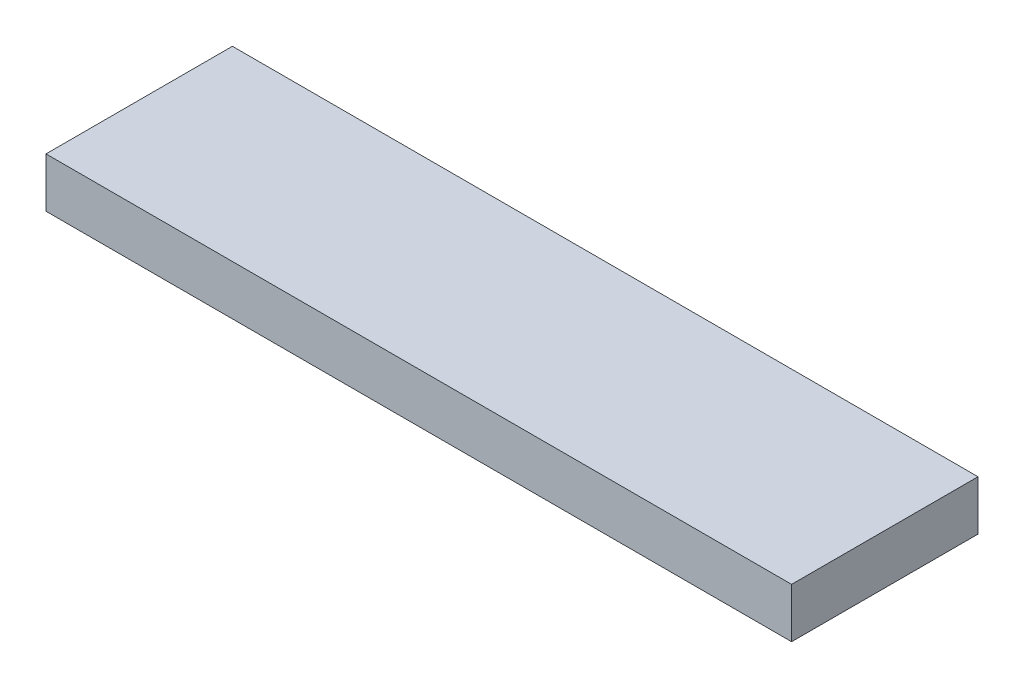
ISO-10303-21;
HEADER;
FILE_DESCRIPTION(('STEP AP214'),'2;1');
FILE_NAME('part.step','',(''),(''),'','','');
FILE_SCHEMA(('AUTOMOTIVE_DESIGN { 1 0 10303 214 1 1 1 1 }'));
ENDSEC;
DATA;
#1=APPLICATION_CONTEXT('core data for automotive mechanical design processes');
#2=APPLICATION_PROTOCOL_DEFINITION('international standard','automotive_design',2000,#1);
#3=PRODUCT_CONTEXT('',#1,'mechanical');
#4=PRODUCT('Part','Part','',(#3));
#5=PRODUCT_RELATED_PRODUCT_CATEGORY('part','',(#4));
#6=PRODUCT_DEFINITION_FORMATION('','',#4);
#7=PRODUCT_DEFINITION_CONTEXT('part definition',#1,'design');
#8=PRODUCT_DEFINITION('design','',#6,#7);
#9=PRODUCT_DEFINITION_SHAPE('','',#8);
#10=(LENGTH_UNIT() NAMED_UNIT(*) SI_UNIT(.MILLI.,.METRE.));
#11=(NAMED_UNIT(*) PLANE_ANGLE_UNIT() SI_UNIT($,.RADIAN.));
#12=(NAMED_UNIT(*) SI_UNIT($,.STERADIAN.) SOLID_ANGLE_UNIT());
#13=UNCERTAINTY_MEASURE_WITH_UNIT(LENGTH_MEASURE(1.E-05),#10,'distance_accuracy_value','');
#14=(GEOMETRIC_REPRESENTATION_CONTEXT(3) GLOBAL_UNCERTAINTY_ASSIGNED_CONTEXT((#13)) GLOBAL_UNIT_ASSIGNED_CONTEXT((#10,
#11,#12)) REPRESENTATION_CONTEXT('',''));
#15=CARTESIAN_POINT('',(0.,0.,0.));
#16=DIRECTION('',(0.,0.,1.));
#17=DIRECTION('',(1.,0.,0.));
#18=AXIS2_PLACEMENT_3D('',#15,#16,#17);
#19=CARTESIAN_POINT('',(-38.1,5.08,-9.525));
#20=DIRECTION('',(1.,0.,0.));
#21=DIRECTION('',(0.,0.,-1.));
#22=AXIS2_PLACEMENT_3D('',#19,#20,#21);
#23=PLANE('',#22);
#24=DIRECTION('',(0.,0.,1.));
#25=VECTOR('',#24,1.);
#26=CARTESIAN_POINT('',(-38.1,0.,-9.525));
#27=LINE('',#26,#25);
#28=CARTESIAN_POINT('',(-38.1,0.,-9.525));
#29=VERTEX_POINT('',#28);
#30=CARTESIAN_POINT('',(-38.1,0.,9.52500000000001));
#31=VERTEX_POINT('',#30);
#32=EDGE_CURVE('E111',#29,#31,#27,.T.);
#33=ORIENTED_EDGE('',*,*,#32,.T.);
#34=DIRECTION('',(0.,-1.,0.));
#35=VECTOR('',#34,1.);
#36=CARTESIAN_POINT('',(-38.1,5.08,9.52500000000001));
#37=LINE('',#36,#35);
#38=CARTESIAN_POINT('',(-38.1,5.08,9.52500000000001));
#39=VERTEX_POINT('',#38);
#40=EDGE_CURVE('E11',#39,#31,#37,.T.);
#41=ORIENTED_EDGE('',*,*,#40,.F.);
#42=DIRECTION('',(0.,0.,1.));
#43=VECTOR('',#42,1.);
#44=CARTESIAN_POINT('',(-38.1,5.08,-9.525));
#45=LINE('',#44,#43);
#46=CARTESIAN_POINT('',(-38.1,5.08,-9.525));
#47=VERTEX_POINT('',#46);
#48=EDGE_CURVE('E95',#47,#39,#45,.T.);
#49=ORIENTED_EDGE('',*,*,#48,.F.);
#50=DIRECTION('',(0.,-1.,0.));
#51=VECTOR('',#50,1.);
#52=CARTESIAN_POINT('',(-38.1,5.08,-9.525));
#53=LINE('',#52,#51);
#54=EDGE_CURVE('E107',#47,#29,#53,.T.);
#55=ORIENTED_EDGE('',*,*,#54,.T.);
#56=EDGE_LOOP('',(#33,#41,#49,#55));
#57=FACE_BOUND('',#56,.T.);
#58=ADVANCED_FACE('F43',(#57),#23,.F.);
#59=CARTESIAN_POINT('',(38.1,5.08,9.525));
#60=DIRECTION('',(0.,0.,-1.));
#61=DIRECTION('',(-1.,0.,0.));
#62=AXIS2_PLACEMENT_3D('',#59,#60,#61);
#63=PLANE('',#62);
#64=DIRECTION('',(1.,0.,0.));
#65=VECTOR('',#64,1.);
#66=CARTESIAN_POINT('',(38.1,0.,9.525));
#67=LINE('',#66,#65);
#68=CARTESIAN_POINT('',(38.1,0.,9.525));
#69=VERTEX_POINT('',#68);
#70=EDGE_CURVE('E100',#31,#69,#67,.T.);
#71=ORIENTED_EDGE('',*,*,#70,.T.);
#72=DIRECTION('',(0.,-1.,0.));
#73=VECTOR('',#72,1.);
#74=CARTESIAN_POINT('',(38.1,5.08,9.525));
#75=LINE('',#74,#73);
#76=CARTESIAN_POINT('',(38.1,5.08,9.525));
#77=VERTEX_POINT('',#76);
#78=EDGE_CURVE('E52',#77,#69,#75,.T.);
#79=ORIENTED_EDGE('',*,*,#78,.F.);
#80=DIRECTION('',(1.,0.,0.));
#81=VECTOR('',#80,1.);
#82=CARTESIAN_POINT('',(38.1,5.08,9.525));
#83=LINE('',#82,#81);
#84=EDGE_CURVE('E90',#39,#77,#83,.T.);
#85=ORIENTED_EDGE('',*,*,#84,.F.);
#86=ORIENTED_EDGE('',*,*,#40,.T.);
#87=EDGE_LOOP('',(#71,#79,#85,#86));
#88=FACE_BOUND('',#87,.T.);
#89=ADVANCED_FACE('F99',(#88),#63,.F.);
#90=CARTESIAN_POINT('',(38.1,5.08,-9.52500000000001));
#91=DIRECTION('',(-1.,0.,0.));
#92=DIRECTION('',(0.,0.,1.));
#93=AXIS2_PLACEMENT_3D('',#90,#91,#92);
#94=PLANE('',#93);
#95=DIRECTION('',(0.,0.,-1.));
#96=VECTOR('',#95,1.);
#97=CARTESIAN_POINT('',(38.1,0.,-9.52500000000001));
#98=LINE('',#97,#96);
#99=CARTESIAN_POINT('',(38.1,0.,-9.52500000000001));
#100=VERTEX_POINT('',#99);
#101=EDGE_CURVE('E77',#69,#100,#98,.T.);
#102=ORIENTED_EDGE('',*,*,#101,.T.);
#103=DIRECTION('',(0.,-1.,0.));
#104=VECTOR('',#103,1.);
#105=CARTESIAN_POINT('',(38.1,5.08,-9.52500000000001));
#106=LINE('',#105,#104);
#107=CARTESIAN_POINT('',(38.1,5.08,-9.52500000000001));
#108=VERTEX_POINT('',#107);
#109=EDGE_CURVE('E102',#108,#100,#106,.T.);
#110=ORIENTED_EDGE('',*,*,#109,.F.);
#111=DIRECTION('',(0.,0.,-1.));
#112=VECTOR('',#111,1.);
#113=CARTESIAN_POINT('',(38.1,5.08,-9.52500000000001));
#114=LINE('',#113,#112);
#115=EDGE_CURVE('E93',#77,#108,#114,.T.);
#116=ORIENTED_EDGE('',*,*,#115,.F.);
#117=ORIENTED_EDGE('',*,*,#78,.T.);
#118=EDGE_LOOP('',(#102,#110,#116,#117));
#119=FACE_BOUND('',#118,.T.);
#120=ADVANCED_FACE('F103',(#119),#94,.F.);
#121=CARTESIAN_POINT('',(38.1,5.08,-9.52500000000001));
#122=DIRECTION('',(0.,0.,1.));
#123=DIRECTION('',(1.,0.,0.));
#124=AXIS2_PLACEMENT_3D('',#121,#122,#123);
#125=PLANE('',#124);
#126=DIRECTION('',(-1.,0.,0.));
#127=VECTOR('',#126,1.);
#128=CARTESIAN_POINT('',(38.1,0.,-9.52500000000001));
#129=LINE('',#128,#127);
#130=EDGE_CURVE('E83',#100,#29,#129,.T.);
#131=ORIENTED_EDGE('',*,*,#130,.T.);
#132=ORIENTED_EDGE('',*,*,#54,.F.);
#133=DIRECTION('',(-1.,0.,0.));
#134=VECTOR('',#133,1.);
#135=CARTESIAN_POINT('',(38.1,5.08,-9.52500000000001));
#136=LINE('',#135,#134);
#137=EDGE_CURVE('E60',#108,#47,#136,.T.);
#138=ORIENTED_EDGE('',*,*,#137,.F.);
#139=ORIENTED_EDGE('',*,*,#109,.T.);
#140=EDGE_LOOP('',(#131,#132,#138,#139));
#141=FACE_BOUND('',#140,.T.);
#142=ADVANCED_FACE('F124',(#141),#125,.F.);
#143=CARTESIAN_POINT('',(0.,5.08,0.));
#144=DIRECTION('',(0.,-1.,0.));
#145=DIRECTION('',(0.,0.,-1.));
#146=AXIS2_PLACEMENT_3D('',#143,#144,#145);
#147=PLANE('',#146);
#148=ORIENTED_EDGE('',*,*,#48,.T.);
#149=ORIENTED_EDGE('',*,*,#84,.T.);
#150=ORIENTED_EDGE('',*,*,#115,.T.);
#151=ORIENTED_EDGE('',*,*,#137,.T.);
#152=EDGE_LOOP('',(#148,#149,#150,#151));
#153=FACE_BOUND('',#152,.T.);
#154=ADVANCED_FACE('F91',(#153),#147,.F.);
#155=CARTESIAN_POINT('',(0.,0.,0.));
#156=DIRECTION('',(0.,-1.,0.));
#157=DIRECTION('',(0.,0.,-1.));
#158=AXIS2_PLACEMENT_3D('',#155,#156,#157);
#159=PLANE('',#158);
#160=ORIENTED_EDGE('',*,*,#32,.F.);
#161=ORIENTED_EDGE('',*,*,#130,.F.);
#162=ORIENTED_EDGE('',*,*,#101,.F.);
#163=ORIENTED_EDGE('',*,*,#70,.F.);
#164=EDGE_LOOP('',(#160,#161,#162,#163));
#165=FACE_BOUND('',#164,.T.);
#166=ADVANCED_FACE('F127',(#165),#159,.T.);
#167=CLOSED_SHELL('',(#58,#89,#120,#142,#154,#166));
#168=MANIFOLD_SOLID_BREP('B2',#167);
#169=ADVANCED_BREP_SHAPE_REPRESENTATION('',(#18,#168),#14);
#170=SHAPE_DEFINITION_REPRESENTATION(#9,#169);
ENDSEC;
END-ISO-10303-21;
